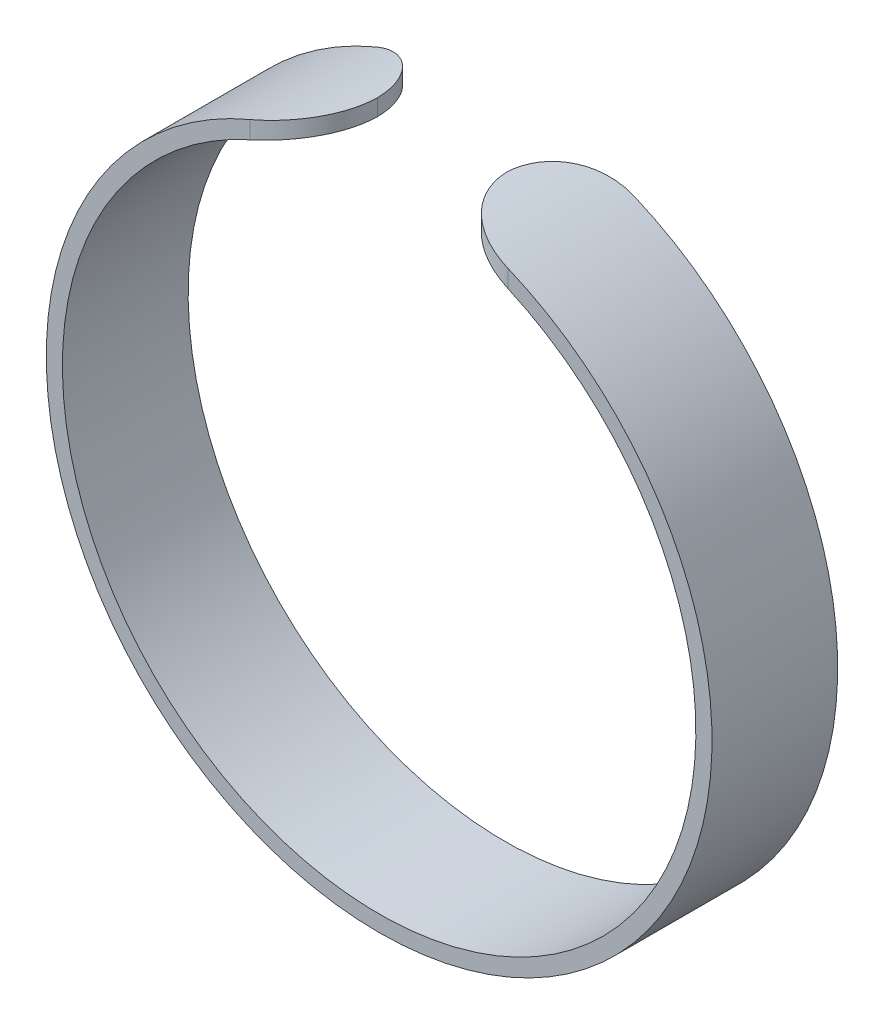
ISO-10303-21;
HEADER;
FILE_DESCRIPTION(('STEP AP214'),'2;1');
FILE_NAME('part.step','',(''),(''),'','','');
FILE_SCHEMA(('AUTOMOTIVE_DESIGN { 1 0 10303 214 1 1 1 1 }'));
ENDSEC;
DATA;
#1=APPLICATION_CONTEXT('core data for automotive mechanical design processes');
#2=APPLICATION_PROTOCOL_DEFINITION('international standard','automotive_design',2000,#1);
#3=PRODUCT_CONTEXT('',#1,'mechanical');
#4=PRODUCT('Part','Part','',(#3));
#5=PRODUCT_RELATED_PRODUCT_CATEGORY('part','',(#4));
#6=PRODUCT_DEFINITION_FORMATION('','',#4);
#7=PRODUCT_DEFINITION_CONTEXT('part definition',#1,'design');
#8=PRODUCT_DEFINITION('design','',#6,#7);
#9=PRODUCT_DEFINITION_SHAPE('','',#8);
#10=(LENGTH_UNIT() NAMED_UNIT(*) SI_UNIT(.MILLI.,.METRE.));
#11=(NAMED_UNIT(*) PLANE_ANGLE_UNIT() SI_UNIT($,.RADIAN.));
#12=(NAMED_UNIT(*) SI_UNIT($,.STERADIAN.) SOLID_ANGLE_UNIT());
#13=UNCERTAINTY_MEASURE_WITH_UNIT(LENGTH_MEASURE(1.E-05),#10,'distance_accuracy_value','');
#14=(GEOMETRIC_REPRESENTATION_CONTEXT(3) GLOBAL_UNCERTAINTY_ASSIGNED_CONTEXT((#13)) GLOBAL_UNIT_ASSIGNED_CONTEXT((#10,
#11,#12)) REPRESENTATION_CONTEXT('',''));
#15=CARTESIAN_POINT('',(0.,0.,0.));
#16=DIRECTION('',(0.,0.,1.));
#17=DIRECTION('',(1.,0.,0.));
#18=AXIS2_PLACEMENT_3D('',#15,#16,#17);
#19=CARTESIAN_POINT('',(0.,0.,7.8));
#20=DIRECTION('',(0.,0.,-1.));
#21=DIRECTION('',(-1.,0.,0.));
#22=AXIS2_PLACEMENT_3D('',#19,#20,#21);
#23=CYLINDRICAL_SURFACE('',#22,19.65);
#24=CARTESIAN_POINT('',(8.,17.9477714494029,7.8));
#25=CARTESIAN_POINT('',(7.88809005336459,17.9976655835803,7.80000932374432));
#26=CARTESIAN_POINT('',(7.7756873025932,18.0465017253565,7.79530340080991));
#27=CARTESIAN_POINT('',(7.55064133487492,18.1418064750824,7.77628156620465));
#28=CARTESIAN_POINT('',(7.43799803981439,18.1882741296171,7.76196181692846));
#29=CARTESIAN_POINT('',(7.21305846917903,18.2786498339844,7.72349007470337));
#30=CARTESIAN_POINT('',(7.10076351091773,18.3225519993548,7.69931641966759));
#31=CARTESIAN_POINT('',(6.87767182517128,18.4074540659507,7.64105025839636));
#32=CARTESIAN_POINT('',(6.76687489585689,18.4484543613613,7.60695910256487));
#33=CARTESIAN_POINT('',(6.54740160579019,18.5274843197794,7.52874852095477));
#34=CARTESIAN_POINT('',(6.43873185566586,18.5655055724089,7.48460198754323));
#35=CARTESIAN_POINT('',(6.22477364762981,18.638333320516,7.38642300724263));
#36=CARTESIAN_POINT('',(6.11948649348473,18.6731385859143,7.33238680102611));
#37=CARTESIAN_POINT('',(5.91353097446289,18.7393792476117,7.21477446345511));
#38=CARTESIAN_POINT('',(5.81285479629114,18.7708204749899,7.15121531348969));
#39=CARTESIAN_POINT('',(5.61689209674453,18.8303880955477,7.01481747190429));
#40=CARTESIAN_POINT('',(5.52160744729377,18.858513341056,6.94197558554557));
#41=CARTESIAN_POINT('',(5.34295727866647,18.9098764253134,6.79213852492775));
#42=CARTESIAN_POINT('',(5.25921974354145,18.9333059355996,6.71565204759649));
#43=CARTESIAN_POINT('',(5.09815016610083,18.9773111598539,6.55539068405679));
#44=CARTESIAN_POINT('',(5.02082047631787,18.997885827568,6.47161314399785));
#45=CARTESIAN_POINT('',(4.87332486779742,19.0362552552994,6.2973847203321));
#46=CARTESIAN_POINT('',(4.8031587605346,19.0540500884807,6.20693401245226));
#47=CARTESIAN_POINT('',(4.67061697357035,19.0869720968837,6.01998686782708));
#48=CARTESIAN_POINT('',(4.60824400397133,19.1020983448408,5.92348834534482));
#49=CARTESIAN_POINT('',(4.49411200093319,19.1292646991117,5.72898329136068));
#50=CARTESIAN_POINT('',(4.44203935448221,19.1414003519237,5.63117393563152));
#51=CARTESIAN_POINT('',(4.34610695814401,19.1634098472032,5.43136362978417));
#52=CARTESIAN_POINT('',(4.30224707361326,19.1732837267517,5.32936274841708));
#53=CARTESIAN_POINT('',(4.22313964746166,19.1908633542236,5.12198015268878));
#54=CARTESIAN_POINT('',(4.18788569571598,19.1985707165287,5.01660102121456));
#55=CARTESIAN_POINT('',(4.12624791652603,19.2119119969768,4.80318677659015));
#56=CARTESIAN_POINT('',(4.09986177673923,19.21754645568,4.69515236371995));
#57=CARTESIAN_POINT('',(4.05209509983849,19.2276825265249,4.45682773781441));
#58=CARTESIAN_POINT('',(4.0325662502832,19.231776802299,4.32614495170229));
#59=CARTESIAN_POINT('',(4.0065139278119,19.2372131813124,4.0636369360569));
#60=CARTESIAN_POINT('',(3.99997047898154,19.2385595119067,3.93181377509165));
#61=CARTESIAN_POINT('',(4.,19.23856803403,3.8));
#62=B_SPLINE_CURVE_WITH_KNOTS('',3,(#24,#25,#26,#27,#28,#29,#30,#31,#32,#33,#34,#35,#36,#37,#38,
#39,#40,#41,#42,#43,#44,#45,#46,#47,#48,#49,#50,#51,#52,#53,#54,#55,#56,#57,#58,#59,#60,#61),
.UNSPECIFIED.,.F.,.F.,(4,2,2,2,2,2,2,2,2,2,2,2,2,2,2,2,2,2,4),(0.,0.367518755734606,
0.735184303300681,1.1036624958823,1.47209053856201,1.84152381084964,2.21109780732097,
2.58002045193414,2.94907040929297,3.29605563121936,3.64316768367631,3.9902705987649,
4.33749388663024,4.67150198549099,5.0055046080006,5.33925768448197,5.67292366492303,
6.0688267405036,6.46412031040639),.UNSPECIFIED.);
#63=CARTESIAN_POINT('',(8.,17.9477714494029,7.8));
#64=VERTEX_POINT('',#63);
#65=CARTESIAN_POINT('',(4.00125019537356,19.238308056428,3.90000000000001));
#66=VERTEX_POINT('',#65);
#67=EDGE_CURVE('E95',#64,#66,#62,.T.);
#68=ORIENTED_EDGE('',*,*,#67,.T.);
#69=CARTESIAN_POINT('',(4.,19.23856803403,4.));
#70=CARTESIAN_POINT('',(3.99998686648455,19.2385636154754,3.88976359395474));
#71=CARTESIAN_POINT('',(4.00455646941222,19.2376204481508,3.77952890042628));
#72=CARTESIAN_POINT('',(4.02276647551041,19.2338246294461,3.55984974181067));
#73=CARTESIAN_POINT('',(4.03640642006805,19.230972074608,3.45040523705295));
#74=CARTESIAN_POINT('',(4.07264567526738,19.2233290392251,3.23318253177841));
#75=CARTESIAN_POINT('',(4.09523668144896,19.2185403548649,3.12540288269779));
#76=CARTESIAN_POINT('',(4.1491915360695,19.2069642400032,2.91217353233591));
#77=CARTESIAN_POINT('',(4.18055527305315,19.2001768348948,2.80672380147199));
#78=CARTESIAN_POINT('',(4.25181262401648,19.1845228727622,2.59886983943899));
#79=CARTESIAN_POINT('',(4.29170882070096,19.1756556861267,2.49646654111442));
#80=CARTESIAN_POINT('',(4.37971378303572,19.1557469757686,2.29542601859533));
#81=CARTESIAN_POINT('',(4.42782556813214,19.1447046523957,2.19679019541561));
#82=CARTESIAN_POINT('',(4.53182520368987,19.1203532732055,2.00406743444661));
#83=CARTESIAN_POINT('',(4.58770898309481,19.107045403294,1.9099781496745));
#84=CARTESIAN_POINT('',(4.70682624491163,19.0780513609658,1.72691032377081));
#85=CARTESIAN_POINT('',(4.77006243110007,19.0623643129797,1.63793368085091));
#86=CARTESIAN_POINT('',(4.90343234663499,19.0284941544969,1.4656051789483));
#87=CARTESIAN_POINT('',(4.97357596925769,19.0103074486424,1.38226168470056));
#88=CARTESIAN_POINT('',(5.12011620635392,18.9713641610258,1.22185767490934));
#89=CARTESIAN_POINT('',(5.19651509551086,18.9506066429867,1.14479946548142));
#90=CARTESIAN_POINT('',(5.35486409459992,18.9064719182761,0.997510608198759));
#91=CARTESIAN_POINT('',(5.43681175344822,18.8830958653545,0.927276978648159));
#92=CARTESIAN_POINT('',(5.60563206854721,18.8336700941089,0.793978182999315));
#93=CARTESIAN_POINT('',(5.69250653346818,18.8076193910177,0.730915675344303));
#94=CARTESIAN_POINT('',(5.87173745998371,18.7524426741433,0.611451796374919));
#95=CARTESIAN_POINT('',(5.96415507210383,18.7232776027059,0.555160061224639));
#96=CARTESIAN_POINT('',(6.15255034410345,18.6622202525107,0.450554900947445));
#97=CARTESIAN_POINT('',(6.24852932747501,18.6303269540118,0.402244478981285));
#98=CARTESIAN_POINT('',(6.54071490293849,18.5306149270078,0.269564453376967));
#99=CARTESIAN_POINT('',(6.74124503556162,18.4587413149161,0.197396619924834));
#100=CARTESIAN_POINT('',(7.11883686627214,18.3161010492841,0.094062206376543));
#101=CARTESIAN_POINT('',(7.29522339307869,18.2466057745343,0.0585507918245499));
#102=CARTESIAN_POINT('',(7.55997053818128,18.1377632219468,0.0232819522319069));
#103=CARTESIAN_POINT('',(7.64817020422259,18.1007501681725,0.0145252013667476));
#104=CARTESIAN_POINT('',(7.82433845957854,18.0252996524898,0.00288418588088229));
#105=CARTESIAN_POINT('',(7.91230707091564,17.9868623320296,-6.60313327061912E-07));
#106=CARTESIAN_POINT('',(8.,17.9477714494029,0.));
#107=B_SPLINE_CURVE_WITH_KNOTS('',3,(#69,#70,#71,#72,#73,#74,#75,#76,#77,#78,#79,#80,#81,#82,
#83,#84,#85,#86,#87,#88,#89,#90,#91,#92,#93,#94,#95,#96,#97,#98,#99,#100,#101,#102,#103,#104,
#105,#106),.UNSPECIFIED.,.F.,.F.,(4,2,2,2,2,2,2,2,2,2,2,2,2,2,2,2,2,2,4),(0.,0.330608103613877,
0.66119949235481,0.991484886256581,1.32176608415694,1.65214739729132,1.98265039667453,
2.31298092245551,2.64343331061127,2.97436607500152,3.30541971983177,3.63632806898527,
3.96735869367631,4.30318110384059,4.63912958886603,5.31075195860414,5.88772673971597,
6.17571042114153,6.46366557829104),.UNSPECIFIED.);
#108=CARTESIAN_POINT('',(8.,17.9477714494029,0.));
#109=VERTEX_POINT('',#108);
#110=EDGE_CURVE('E90',#66,#109,#107,.T.);
#111=ORIENTED_EDGE('',*,*,#110,.T.);
#112=CARTESIAN_POINT('',(0.,0.,0.));
#113=DIRECTION('',(0.,0.,-1.));
#114=DIRECTION('',(1.,0.,0.));
#115=AXIS2_PLACEMENT_3D('',#112,#113,#114);
#116=CIRCLE('',#115,19.65);
#117=CARTESIAN_POINT('',(-8.00000000000001,17.9477714494028,0.));
#118=VERTEX_POINT('',#117);
#119=EDGE_CURVE('E92',#109,#118,#116,.T.);
#120=ORIENTED_EDGE('',*,*,#119,.T.);
#121=CARTESIAN_POINT('',(-8.00000000000001,17.9477714494028,0.));
#122=CARTESIAN_POINT('',(-7.8880900533646,17.9976655835803,-9.32374431702631E-06));
#123=CARTESIAN_POINT('',(-7.7756873025932,18.0465017253565,0.00469659919009254));
#124=CARTESIAN_POINT('',(-7.55064133487493,18.1418064750824,0.023718433795353));
#125=CARTESIAN_POINT('',(-7.4379980398144,18.1882741296171,0.0380381830715341));
#126=CARTESIAN_POINT('',(-7.21305846917904,18.2786498339844,0.0765099252966335));
#127=CARTESIAN_POINT('',(-7.10076351091774,18.3225519993548,0.100683580332411));
#128=CARTESIAN_POINT('',(-6.87767182517128,18.4074540659507,0.15894974160364));
#129=CARTESIAN_POINT('',(-6.7668748958569,18.4484543613613,0.193040897435133));
#130=CARTESIAN_POINT('',(-6.54740160579019,18.5274843197794,0.271251479045227));
#131=CARTESIAN_POINT('',(-6.43873185566586,18.5655055724089,0.315398012456776));
#132=CARTESIAN_POINT('',(-6.22477364762981,18.638333320516,0.413576992757369));
#133=CARTESIAN_POINT('',(-6.11948649348474,18.6731385859143,0.467613198973888));
#134=CARTESIAN_POINT('',(-5.91353097446289,18.7393792476117,0.585225536544889));
#135=CARTESIAN_POINT('',(-5.81285479629114,18.7708204749899,0.648784686510316));
#136=CARTESIAN_POINT('',(-5.61689209674453,18.8303880955477,0.785182528095711));
#137=CARTESIAN_POINT('',(-5.52160744729377,18.858513341056,0.858024414454432));
#138=CARTESIAN_POINT('',(-5.34295727866647,18.9098764253134,1.00786147507226));
#139=CARTESIAN_POINT('',(-5.25921974354145,18.9333059355996,1.08434795240352));
#140=CARTESIAN_POINT('',(-5.09815016610083,18.9773111598539,1.24460931594322));
#141=CARTESIAN_POINT('',(-5.02082047631787,18.997885827568,1.32838685600216));
#142=CARTESIAN_POINT('',(-4.87332486779742,19.0362552552994,1.50261527966791));
#143=CARTESIAN_POINT('',(-4.8031587605346,19.0540500884807,1.59306598754775));
#144=CARTESIAN_POINT('',(-4.67061697357036,19.0869720968837,1.78001313217293));
#145=CARTESIAN_POINT('',(-4.60824400397133,19.1020983448408,1.87651165465518));
#146=CARTESIAN_POINT('',(-4.49411200093319,19.1292646991117,2.07101670863933));
#147=CARTESIAN_POINT('',(-4.44203935448221,19.1414003519237,2.16882606436849));
#148=CARTESIAN_POINT('',(-4.34610695814401,19.1634098472032,2.36863637021584));
#149=CARTESIAN_POINT('',(-4.30224707361327,19.1732837267517,2.47063725158293));
#150=CARTESIAN_POINT('',(-4.22313964746166,19.1908633542236,2.67801984731123));
#151=CARTESIAN_POINT('',(-4.18788569571599,19.1985707165287,2.78339897878545));
#152=CARTESIAN_POINT('',(-4.12624791652604,19.2119119969768,2.99681322340986));
#153=CARTESIAN_POINT('',(-4.09986177673924,19.21754645568,3.10484763628006));
#154=CARTESIAN_POINT('',(-4.05209509983849,19.2276825265249,3.3431722621856));
#155=CARTESIAN_POINT('',(-4.0325662502832,19.231776802299,3.47385504829771));
#156=CARTESIAN_POINT('',(-4.00651392781191,19.2372131813124,3.7363630639431));
#157=CARTESIAN_POINT('',(-3.99997047898154,19.2385595119067,3.86818622490835));
#158=CARTESIAN_POINT('',(-4.,19.23856803403,4.));
#159=B_SPLINE_CURVE_WITH_KNOTS('',3,(#121,#122,#123,#124,#125,#126,#127,#128,#129,#130,#131,
#132,#133,#134,#135,#136,#137,#138,#139,#140,#141,#142,#143,#144,#145,#146,#147,#148,#149,#150,
#151,#152,#153,#154,#155,#156,#157,#158),.UNSPECIFIED.,.F.,.F.,(4,2,2,2,2,2,2,2,2,2,2,2,2,2,2,2,
2,2,4),(0.,0.367518755734607,0.735184303300683,1.1036624958823,1.47209053856202,
1.84152381084964,2.21109780732098,2.58002045193415,2.94907040929299,3.29605563121938,
3.64316768367633,3.99027059876491,4.33749388663025,4.671501985491,5.00550460800062,
5.33925768448199,5.67292366492305,6.06882674050361,6.4641203104064),.UNSPECIFIED.);
#160=CARTESIAN_POINT('',(-4.00125019537356,19.238308056428,3.89999999999997));
#161=VERTEX_POINT('',#160);
#162=EDGE_CURVE('E161',#118,#161,#159,.T.);
#163=ORIENTED_EDGE('',*,*,#162,.T.);
#164=CARTESIAN_POINT('',(-4.,19.23856803403,3.8));
#165=CARTESIAN_POINT('',(-3.99998686648455,19.2385636154754,3.91023640604526));
#166=CARTESIAN_POINT('',(-4.00455646941223,19.2376204481508,4.02047109957372));
#167=CARTESIAN_POINT('',(-4.02276647551042,19.2338246294461,4.24015025818933));
#168=CARTESIAN_POINT('',(-4.03640642006806,19.230972074608,4.34959476294704));
#169=CARTESIAN_POINT('',(-4.07264567526739,19.2233290392251,4.56681746822159));
#170=CARTESIAN_POINT('',(-4.09523668144897,19.2185403548649,4.6745971173022));
#171=CARTESIAN_POINT('',(-4.14919153606951,19.2069642400032,4.88782646766409));
#172=CARTESIAN_POINT('',(-4.18055527305316,19.2001768348948,4.99327619852801));
#173=CARTESIAN_POINT('',(-4.25181262401649,19.1845228727622,5.20113016056101));
#174=CARTESIAN_POINT('',(-4.29170882070097,19.1756556861267,5.30353345888558));
#175=CARTESIAN_POINT('',(-4.37971378303573,19.1557469757686,5.50457398140467));
#176=CARTESIAN_POINT('',(-4.42782556813215,19.1447046523957,5.60320980458439));
#177=CARTESIAN_POINT('',(-4.53182520368987,19.1203532732055,5.79593256555339));
#178=CARTESIAN_POINT('',(-4.58770898309482,19.1070454032939,5.8900218503255));
#179=CARTESIAN_POINT('',(-4.70682624491164,19.0780513609658,6.07308967622919));
#180=CARTESIAN_POINT('',(-4.77006243110007,19.0623643129797,6.16206631914909));
#181=CARTESIAN_POINT('',(-4.903432346635,19.0284941544969,6.3343948210517));
#182=CARTESIAN_POINT('',(-4.9735759692577,19.0103074486424,6.41773831529944));
#183=CARTESIAN_POINT('',(-5.12011620635393,18.9713641610258,6.57814232509066));
#184=CARTESIAN_POINT('',(-5.19651509551087,18.9506066429867,6.65520053451858));
#185=CARTESIAN_POINT('',(-5.35486409459993,18.9064719182761,6.80248939180124));
#186=CARTESIAN_POINT('',(-5.43681175344823,18.8830958653545,6.87272302135184));
#187=CARTESIAN_POINT('',(-5.60563206854722,18.8336700941089,7.00602181700068));
#188=CARTESIAN_POINT('',(-5.69250653346818,18.8076193910177,7.06908432465569));
#189=CARTESIAN_POINT('',(-5.87173745998371,18.7524426741433,7.18854820362508));
#190=CARTESIAN_POINT('',(-5.96415507210383,18.7232776027059,7.24483993877536));
#191=CARTESIAN_POINT('',(-6.15255034410345,18.6622202525107,7.34944509905255));
#192=CARTESIAN_POINT('',(-6.24852932747501,18.6303269540118,7.39775552101871));
#193=CARTESIAN_POINT('',(-6.54071490293849,18.5306149270078,7.53043554662303));
#194=CARTESIAN_POINT('',(-6.74124503556163,18.4587413149161,7.60260338007516));
#195=CARTESIAN_POINT('',(-7.11883686627215,18.3161010492841,7.70593779362346));
#196=CARTESIAN_POINT('',(-7.2952233930787,18.2466057745343,7.74144920817545));
#197=CARTESIAN_POINT('',(-7.55997053818129,18.1377632219468,7.77671804776809));
#198=CARTESIAN_POINT('',(-7.6481702042226,18.1007501681725,7.78547479863325));
#199=CARTESIAN_POINT('',(-7.82433845957855,18.0252996524898,7.79711581411912));
#200=CARTESIAN_POINT('',(-7.91230707091565,17.9868623320296,7.80000066031333));
#201=CARTESIAN_POINT('',(-8.00000000000001,17.9477714494028,7.8));
#202=B_SPLINE_CURVE_WITH_KNOTS('',3,(#164,#165,#166,#167,#168,#169,#170,#171,#172,#173,#174,
#175,#176,#177,#178,#179,#180,#181,#182,#183,#184,#185,#186,#187,#188,#189,#190,#191,#192,#193,
#194,#195,#196,#197,#198,#199,#200,#201),.UNSPECIFIED.,.F.,.F.,(4,2,2,2,2,2,2,2,2,2,2,2,2,2,2,2,
2,2,4),(0.,0.330608103613877,0.661199492354809,0.99148488625658,1.32176608415694,
1.65214739729132,1.98265039667453,2.31298092245552,2.64343331061128,2.97436607500152,
3.30541971983177,3.63632806898527,3.96735869367631,4.30318110384059,4.63912958886603,
5.31075195860413,5.88772673971597,6.17571042114154,6.46366557829105),.UNSPECIFIED.);
#203=CARTESIAN_POINT('',(-8.00000000000001,17.9477714494028,7.8));
#204=VERTEX_POINT('',#203);
#205=EDGE_CURVE('E169',#161,#204,#202,.T.);
#206=ORIENTED_EDGE('',*,*,#205,.T.);
#207=CARTESIAN_POINT('',(0.,0.,7.8));
#208=DIRECTION('',(0.,0.,-1.));
#209=DIRECTION('',(1.,0.,0.));
#210=AXIS2_PLACEMENT_3D('',#207,#208,#209);
#211=CIRCLE('',#210,19.65);
#212=EDGE_CURVE('E175',#64,#204,#211,.T.);
#213=ORIENTED_EDGE('',*,*,#212,.F.);
#214=EDGE_LOOP('',(#68,#111,#120,#163,#206,#213));
#215=FACE_BOUND('',#214,.T.);
#216=ADVANCED_FACE('F35',(#215),#23,.F.);
#217=CARTESIAN_POINT('',(0.,0.,7.8));
#218=DIRECTION('',(0.,0.,-1.));
#219=DIRECTION('',(-1.,0.,0.));
#220=AXIS2_PLACEMENT_3D('',#217,#218,#219);
#221=CYLINDRICAL_SURFACE('',#220,20.65);
#222=CARTESIAN_POINT('',(0.,0.,0.));
#223=DIRECTION('',(0.,0.,1.));
#224=DIRECTION('',(1.,0.,0.));
#225=AXIS2_PLACEMENT_3D('',#222,#223,#224);
#226=CIRCLE('',#225,20.65);
#227=CARTESIAN_POINT('',(-8.00000000000001,19.0373974061582,0.));
#228=VERTEX_POINT('',#227);
#229=CARTESIAN_POINT('',(8.,19.0373974061582,0.));
#230=VERTEX_POINT('',#229);
#231=EDGE_CURVE('E109',#228,#230,#226,.T.);
#232=ORIENTED_EDGE('',*,*,#231,.T.);
#233=CARTESIAN_POINT('',(8.,19.0373974061582,0.));
#234=CARTESIAN_POINT('',(7.88801991177646,19.0844651702443,-9.61645803382828E-06));
#235=CARTESIAN_POINT('',(7.77560107805466,19.1305333367053,0.0047024167130644));
#236=CARTESIAN_POINT('',(7.55063599195092,19.2204308910369,0.0237203550945149));
#237=CARTESIAN_POINT('',(7.4380897084812,19.2642594772961,0.0380296699233114));
#238=CARTESIAN_POINT('',(7.2134878134453,19.3494851776599,0.0764293289514073));
#239=CARTESIAN_POINT('',(7.10143353671701,19.3908775243053,0.100538165915066));
#240=CARTESIAN_POINT('',(6.87891865168001,19.470925736618,0.158594781993855));
#241=CARTESIAN_POINT('',(6.76845784766073,19.5095819406568,0.192541341849818));
#242=CARTESIAN_POINT('',(6.54976338303463,19.5840874105833,0.27034629916117));
#243=CARTESIAN_POINT('',(6.44153591731002,19.6199294859551,0.314229041758163));
#244=CARTESIAN_POINT('',(6.22851261333964,19.6885921122131,0.411747091554131));
#245=CARTESIAN_POINT('',(6.12371809240857,19.7214115117676,0.465386091941208));
#246=CARTESIAN_POINT('',(5.91874980628709,19.7838915111392,0.582064756525221));
#247=CARTESIAN_POINT('',(5.81856879685724,19.8135571660666,0.645088975631585));
#248=CARTESIAN_POINT('',(5.62357777370212,19.869780418638,0.780264865337175));
#249=CARTESIAN_POINT('',(5.52876964228325,19.8963369304716,0.852419706439391));
#250=CARTESIAN_POINT('',(5.35042191332044,19.9450136558673,1.00125117655004));
#251=CARTESIAN_POINT('',(5.26655069246968,19.9672953734111,1.07747803030275));
#252=CARTESIAN_POINT('',(5.10522122760203,20.0091520330463,1.2371856840178));
#253=CARTESIAN_POINT('',(5.02776534526005,20.0287259800892,1.32066913237155));
#254=CARTESIAN_POINT('',(4.88001018559767,20.0652384538619,1.49427532137171));
#255=CARTESIAN_POINT('',(4.80971060678917,20.0821770916307,1.58439778204706));
#256=CARTESIAN_POINT('',(4.67687919397024,20.1135268325019,1.77066006787088));
#257=CARTESIAN_POINT('',(4.61435006992247,20.1279370545317,1.86680197483308));
#258=CARTESIAN_POINT('',(4.49966953980952,20.1538783301026,2.0609394807028));
#259=CARTESIAN_POINT('',(4.44723456442481,20.1654915517932,2.158756745646));
#260=CARTESIAN_POINT('',(4.35059936158604,20.1865606663226,2.35860002791256));
#261=CARTESIAN_POINT('',(4.30639901550592,20.1960165902392,2.46062598458068));
#262=CARTESIAN_POINT('',(4.22662916865828,20.2128615184495,2.66807954945382));
#263=CARTESIAN_POINT('',(4.19105348184226,20.2202520047659,2.77350465775263));
#264=CARTESIAN_POINT('',(4.12879064463516,20.2330568057369,2.9870298354714));
#265=CARTESIAN_POINT('',(4.10210121819521,20.2384716264554,3.09512921229536));
#266=CARTESIAN_POINT('',(4.05339541856416,20.2482905526915,3.33507644223347));
#267=CARTESIAN_POINT('',(4.03337948394125,20.2522762843493,3.46735223577799));
#268=CARTESIAN_POINT('',(4.0066765711108,20.257568187317,3.73309024413077));
#269=CARTESIAN_POINT('',(3.99996927345758,20.2588784435955,3.8665503373079));
#270=CARTESIAN_POINT('',(4.,20.2588869388227,4.));
#271=B_SPLINE_CURVE_WITH_KNOTS('',3,(#233,#234,#235,#236,#237,#238,#239,#240,#241,#242,#243,
#244,#245,#246,#247,#248,#249,#250,#251,#252,#253,#254,#255,#256,#257,#258,#259,#260,#261,#262,
#263,#264,#265,#266,#267,#268,#269,#270),.UNSPECIFIED.,.F.,.F.,(4,2,2,2,2,2,2,2,2,2,2,2,2,2,2,2,
2,2,4),(0.,0.364338786012961,0.728807078981445,1.09396638030283,1.45908044416799,
1.82509896301786,2.19125632601167,2.55681763659739,2.92250623424871,3.26859065768149,
3.61480192389581,3.96099859852504,4.30731567314858,4.64168690256026,4.97605331472901,
5.31017918785049,5.6442194149449,6.04502961296618,6.44522738710803),.UNSPECIFIED.);
#272=CARTESIAN_POINT('',(4.00125019537356,20.2586400549006,3.89999999999999));
#273=VERTEX_POINT('',#272);
#274=EDGE_CURVE('E53',#230,#273,#271,.T.);
#275=ORIENTED_EDGE('',*,*,#274,.T.);
#276=CARTESIAN_POINT('',(4.,20.2588869388227,3.8));
#277=CARTESIAN_POINT('',(3.9999869589523,20.2588826989038,3.91045276225946));
#278=CARTESIAN_POINT('',(4.0045743788701,20.2579835402437,4.02090380966646));
#279=CARTESIAN_POINT('',(4.02285611970234,20.254364695957,4.24101427269968));
#280=CARTESIAN_POINT('',(4.03654998233435,20.251645101944,4.35067372788214));
#281=CARTESIAN_POINT('',(4.07293405020711,20.2443580189029,4.56832504535302));
#282=CARTESIAN_POINT('',(4.09561606104843,20.2397922129696,4.67631833375417));
#283=CARTESIAN_POINT('',(4.14979125230746,20.2287543169084,4.88997062372404));
#284=CARTESIAN_POINT('',(4.18128432119924,20.2222822509089,4.99562965482036));
#285=CARTESIAN_POINT('',(4.25284068594218,20.2073545933968,5.20389637771441));
#286=CARTESIAN_POINT('',(4.29290657526298,20.1988984015669,5.30650313540809));
#287=CARTESIAN_POINT('',(4.38129408640718,20.1799109281053,5.50794301533185));
#288=CARTESIAN_POINT('',(4.42961874442463,20.1693788831031,5.60677473332609));
#289=CARTESIAN_POINT('',(4.53409056976994,20.1461505730912,5.79987909755671));
#290=CARTESIAN_POINT('',(4.59023362157747,20.1334554459244,5.89415410745282));
#291=CARTESIAN_POINT('',(4.70992054205286,20.1057932117385,6.07758076219444));
#292=CARTESIAN_POINT('',(4.77346713304658,20.0908252683736,6.16673050433864));
#293=CARTESIAN_POINT('',(4.90750378742401,20.0585060092431,6.33937502977373));
#294=CARTESIAN_POINT('',(4.97800272918544,20.0411516344809,6.42286234633384));
#295=CARTESIAN_POINT('',(5.12531374637776,20.0039853511166,6.58353418133736));
#296=CARTESIAN_POINT('',(5.20212812178149,19.9841725458465,6.6607163829828));
#297=CARTESIAN_POINT('',(5.36137574872401,19.9420392201543,6.80822814193691));
#298=CARTESIAN_POINT('',(5.44380665540694,19.9197197437543,6.8785605295529));
#299=CARTESIAN_POINT('',(5.61366503732317,19.8725196977168,7.01202083746527));
#300=CARTESIAN_POINT('',(5.70109434295617,19.847638187163,7.07514609283902));
#301=CARTESIAN_POINT('',(5.88140320438407,19.7949620273021,7.19461206840081));
#302=CARTESIAN_POINT('',(5.97433939775076,19.7671333116338,7.250852427404));
#303=CARTESIAN_POINT('',(6.16384347753876,19.7088659349009,7.355314035848));
#304=CARTESIAN_POINT('',(6.2604127260049,19.678426289404,7.40353224027095));
#305=CARTESIAN_POINT('',(6.55446450179837,19.5832510309271,7.53584331965625));
#306=CARTESIAN_POINT('',(6.75638723242667,19.51463137758,7.60765583137141));
#307=CARTESIAN_POINT('',(7.13258211295835,19.3799404849442,7.70886497707664));
#308=CARTESIAN_POINT('',(7.30604927078716,19.315249499765,7.74324076824254));
#309=CARTESIAN_POINT('',(7.5665846984226,19.2140047740255,7.77741234581396));
#310=CARTESIAN_POINT('',(7.65341229356233,19.1795859373957,7.78590433420851));
#311=CARTESIAN_POINT('',(7.82690551428161,19.1094433081465,7.7971984723072));
#312=CARTESIAN_POINT('',(7.91357114893499,19.0737195910865,7.80000095093323));
#313=CARTESIAN_POINT('',(8.,19.0373974061582,7.8));
#314=B_SPLINE_CURVE_WITH_KNOTS('',3,(#276,#277,#278,#279,#280,#281,#282,#283,#284,#285,#286,
#287,#288,#289,#290,#291,#292,#293,#294,#295,#296,#297,#298,#299,#300,#301,#302,#303,#304,#305,
#306,#307,#308,#309,#310,#311,#312,#313),.UNSPECIFIED.,.F.,.F.,(4,2,2,2,2,2,2,2,2,2,2,2,2,2,2,2,
2,2,4),(0.,0.331256990719271,0.66249731216612,0.99343633755282,1.32437117426946,
1.65540626807279,1.98656332405277,2.3175467167562,2.64865220045786,2.98018613119503,
3.31184134032623,3.6433589246317,3.97499869719048,4.31100851515773,4.64714558485435,
5.31906881529155,5.88240563132743,6.16360038840817,6.44477888859657),.UNSPECIFIED.);
#315=CARTESIAN_POINT('',(8.,19.0373974061582,7.8));
#316=VERTEX_POINT('',#315);
#317=EDGE_CURVE('E139',#273,#316,#314,.T.);
#318=ORIENTED_EDGE('',*,*,#317,.T.);
#319=CARTESIAN_POINT('',(0.,0.,7.8));
#320=DIRECTION('',(0.,0.,1.));
#321=DIRECTION('',(1.,0.,0.));
#322=AXIS2_PLACEMENT_3D('',#319,#320,#321);
#323=CIRCLE('',#322,20.65);
#324=CARTESIAN_POINT('',(-8.00000000000001,19.0373974061582,7.8));
#325=VERTEX_POINT('',#324);
#326=EDGE_CURVE('E174',#325,#316,#323,.T.);
#327=ORIENTED_EDGE('',*,*,#326,.F.);
#328=CARTESIAN_POINT('',(-8.00000000000001,19.0373974061582,7.8));
#329=CARTESIAN_POINT('',(-7.88801991177647,19.0844651702443,7.80000961645803));
#330=CARTESIAN_POINT('',(-7.77560107805466,19.1305333367053,7.79529758328693));
#331=CARTESIAN_POINT('',(-7.55063599195093,19.2204308910369,7.77627964490548));
#332=CARTESIAN_POINT('',(-7.4380897084812,19.2642594772961,7.76197033007669));
#333=CARTESIAN_POINT('',(-7.21348781344531,19.3494851776599,7.72357067104859));
#334=CARTESIAN_POINT('',(-7.10143353671702,19.3908775243053,7.69946183408493));
#335=CARTESIAN_POINT('',(-6.87891865168001,19.470925736618,7.64140521800614));
#336=CARTESIAN_POINT('',(-6.76845784766073,19.5095819406568,7.60745865815018));
#337=CARTESIAN_POINT('',(-6.54976338303463,19.5840874105833,7.52965370083883));
#338=CARTESIAN_POINT('',(-6.44153591731002,19.6199294859551,7.48577095824183));
#339=CARTESIAN_POINT('',(-6.22851261333964,19.6885921122131,7.38825290844587));
#340=CARTESIAN_POINT('',(-6.12371809240857,19.7214115117676,7.33461390805879));
#341=CARTESIAN_POINT('',(-5.91874980628709,19.7838915111392,7.21793524347477));
#342=CARTESIAN_POINT('',(-5.81856879685724,19.8135571660666,7.15491102436841));
#343=CARTESIAN_POINT('',(-5.62357777370212,19.869780418638,7.01973513466282));
#344=CARTESIAN_POINT('',(-5.52876964228325,19.8963369304716,6.9475802935606));
#345=CARTESIAN_POINT('',(-5.35042191332044,19.9450136558673,6.79874882344995));
#346=CARTESIAN_POINT('',(-5.26655069246968,19.9672953734111,6.72252196969724));
#347=CARTESIAN_POINT('',(-5.10522122760203,20.0091520330463,6.56281431598219));
#348=CARTESIAN_POINT('',(-5.02776534526005,20.0287259800892,6.47933086762844));
#349=CARTESIAN_POINT('',(-4.88001018559767,20.0652384538619,6.30572467862828));
#350=CARTESIAN_POINT('',(-4.80971060678916,20.0821770916307,6.21560221795294));
#351=CARTESIAN_POINT('',(-4.67687919397024,20.1135268325019,6.02933993212911));
#352=CARTESIAN_POINT('',(-4.61435006992247,20.1279370545317,5.93319802516692));
#353=CARTESIAN_POINT('',(-4.49966953980952,20.1538783301026,5.73906051929719));
#354=CARTESIAN_POINT('',(-4.44723456442481,20.1654915517932,5.64124325435399));
#355=CARTESIAN_POINT('',(-4.35059936158604,20.1865606663226,5.44139997208743));
#356=CARTESIAN_POINT('',(-4.30639901550592,20.1960165902392,5.33937401541931));
#357=CARTESIAN_POINT('',(-4.22662916865828,20.2128615184495,5.13192045054617));
#358=CARTESIAN_POINT('',(-4.19105348184226,20.2202520047659,5.02649534224737));
#359=CARTESIAN_POINT('',(-4.12879064463516,20.2330568057369,4.81297016452859));
#360=CARTESIAN_POINT('',(-4.10210121819521,20.2384716264554,4.70487078770463));
#361=CARTESIAN_POINT('',(-4.05339541856416,20.2482905526915,4.46492355776652));
#362=CARTESIAN_POINT('',(-4.03337948394125,20.2522762843493,4.332647764222));
#363=CARTESIAN_POINT('',(-4.0066765711108,20.257568187317,4.06690975586923));
#364=CARTESIAN_POINT('',(-3.99996927345758,20.2588784435955,3.9334496626921));
#365=CARTESIAN_POINT('',(-4.,20.2588869388227,3.8));
#366=B_SPLINE_CURVE_WITH_KNOTS('',3,(#328,#329,#330,#331,#332,#333,#334,#335,#336,#337,#338,
#339,#340,#341,#342,#343,#344,#345,#346,#347,#348,#349,#350,#351,#352,#353,#354,#355,#356,#357,
#358,#359,#360,#361,#362,#363,#364,#365),.UNSPECIFIED.,.F.,.F.,(4,2,2,2,2,2,2,2,2,2,2,2,2,2,2,2,
2,2,4),(0.,0.364338786012964,0.728807078981448,1.09396638030284,1.45908044416799,
1.82509896301787,2.19125632601168,2.5568176365974,2.92250623424873,3.2685906576815,
3.61480192389583,3.96099859852505,4.30731567314859,4.64168690256027,4.97605331472902,
5.3101791878505,5.64421941494491,6.04502961296618,6.44522738710803),.UNSPECIFIED.);
#367=CARTESIAN_POINT('',(-4.00125019537356,20.2586400549006,3.89999999999997));
#368=VERTEX_POINT('',#367);
#369=EDGE_CURVE('E60',#325,#368,#366,.T.);
#370=ORIENTED_EDGE('',*,*,#369,.T.);
#371=CARTESIAN_POINT('',(-4.,20.2588869388227,4.));
#372=CARTESIAN_POINT('',(-3.9999869589523,20.2588826989038,3.88954723774054));
#373=CARTESIAN_POINT('',(-4.0045743788701,20.2579835402437,3.77909619033354));
#374=CARTESIAN_POINT('',(-4.02285611970234,20.254364695957,3.55898572730032));
#375=CARTESIAN_POINT('',(-4.03654998233435,20.251645101944,3.44932627211786));
#376=CARTESIAN_POINT('',(-4.07293405020712,20.2443580189029,3.23167495464698));
#377=CARTESIAN_POINT('',(-4.09561606104844,20.2397922129696,3.12368166624583));
#378=CARTESIAN_POINT('',(-4.14979125230747,20.2287543169084,2.91002937627596));
#379=CARTESIAN_POINT('',(-4.18128432119924,20.2222822509089,2.80437034517964));
#380=CARTESIAN_POINT('',(-4.25284068594218,20.2073545933968,2.59610362228559));
#381=CARTESIAN_POINT('',(-4.29290657526298,20.1988984015669,2.49349686459191));
#382=CARTESIAN_POINT('',(-4.38129408640718,20.1799109281053,2.29205698466815));
#383=CARTESIAN_POINT('',(-4.42961874442463,20.1693788831031,2.19322526667391));
#384=CARTESIAN_POINT('',(-4.53409056976994,20.1461505730912,2.00012090244329));
#385=CARTESIAN_POINT('',(-4.59023362157748,20.1334554459244,1.90584589254718));
#386=CARTESIAN_POINT('',(-4.70992054205286,20.1057932117385,1.72241923780556));
#387=CARTESIAN_POINT('',(-4.77346713304658,20.0908252683736,1.63326949566137));
#388=CARTESIAN_POINT('',(-4.90750378742401,20.0585060092431,1.46062497022627));
#389=CARTESIAN_POINT('',(-4.97800272918544,20.0411516344809,1.37713765366616));
#390=CARTESIAN_POINT('',(-5.12531374637776,20.0039853511166,1.21646581866265));
#391=CARTESIAN_POINT('',(-5.20212812178149,19.9841725458465,1.13928361701721));
#392=CARTESIAN_POINT('',(-5.36137574872401,19.9420392201543,0.991771858063091));
#393=CARTESIAN_POINT('',(-5.44380665540694,19.9197197437543,0.921439470447106));
#394=CARTESIAN_POINT('',(-5.61366503732317,19.8725196977168,0.787979162534735));
#395=CARTESIAN_POINT('',(-5.70109434295617,19.847638187163,0.724853907160978));
#396=CARTESIAN_POINT('',(-5.88140320438407,19.7949620273021,0.605387931599189));
#397=CARTESIAN_POINT('',(-5.97433939775076,19.7671333116338,0.549147572595998));
#398=CARTESIAN_POINT('',(-6.16384347753876,19.7088659349009,0.444685964151998));
#399=CARTESIAN_POINT('',(-6.2604127260049,19.678426289404,0.396467759729054));
#400=CARTESIAN_POINT('',(-6.55446450179837,19.5832510309271,0.264156680343755));
#401=CARTESIAN_POINT('',(-6.75638723242667,19.51463137758,0.192344168628594));
#402=CARTESIAN_POINT('',(-7.13258211295835,19.3799404849442,0.091135022923362));
#403=CARTESIAN_POINT('',(-7.30604927078716,19.315249499765,0.0567592317574592));
#404=CARTESIAN_POINT('',(-7.5665846984226,19.2140047740255,0.0225876541860385));
#405=CARTESIAN_POINT('',(-7.65341229356233,19.1795859373957,0.0140956657914856));
#406=CARTESIAN_POINT('',(-7.82690551428162,19.1094433081465,0.00280152769280151));
#407=CARTESIAN_POINT('',(-7.913571148935,19.0737195910865,-9.50933228939361E-07));
#408=CARTESIAN_POINT('',(-8.00000000000001,19.0373974061582,0.));
#409=B_SPLINE_CURVE_WITH_KNOTS('',3,(#371,#372,#373,#374,#375,#376,#377,#378,#379,#380,#381,
#382,#383,#384,#385,#386,#387,#388,#389,#390,#391,#392,#393,#394,#395,#396,#397,#398,#399,#400,
#401,#402,#403,#404,#405,#406,#407,#408),.UNSPECIFIED.,.F.,.F.,(4,2,2,2,2,2,2,2,2,2,2,2,2,2,2,2,
2,2,4),(0.,0.331256990719271,0.66249731216612,0.993436337552822,1.32437117426946,
1.65540626807278,1.98656332405277,2.3175467167562,2.64865220045785,2.98018613119503,
3.31184134032623,3.6433589246317,3.97499869719047,4.31100851515772,4.64714558485434,
5.31906881529155,5.88240563132744,6.16360038840817,6.44477888859658),.UNSPECIFIED.);
#410=EDGE_CURVE('E114',#368,#228,#409,.T.);
#411=ORIENTED_EDGE('',*,*,#410,.T.);
#412=EDGE_LOOP('',(#232,#275,#318,#327,#370,#411));
#413=FACE_BOUND('',#412,.T.);
#414=ADVANCED_FACE('F126',(#413),#221,.T.);
#415=CARTESIAN_POINT('',(0.,0.,7.8));
#416=DIRECTION('',(0.,0.,1.));
#417=DIRECTION('',(1.,0.,0.));
#418=AXIS2_PLACEMENT_3D('',#415,#416,#417);
#419=PLANE('',#418);
#420=ORIENTED_EDGE('',*,*,#326,.T.);
#421=DIRECTION('',(0.,-1.,0.));
#422=VECTOR('',#421,1.);
#423=CARTESIAN_POINT('',(8.,19.23856803403,7.8));
#424=LINE('',#423,#422);
#425=EDGE_CURVE('E11',#316,#64,#424,.T.);
#426=ORIENTED_EDGE('',*,*,#425,.T.);
#427=ORIENTED_EDGE('',*,*,#212,.T.);
#428=DIRECTION('',(0.,1.,0.));
#429=VECTOR('',#428,1.);
#430=CARTESIAN_POINT('',(-8.,20.2588869388227,7.8));
#431=LINE('',#430,#429);
#432=EDGE_CURVE('E45',#204,#325,#431,.T.);
#433=ORIENTED_EDGE('',*,*,#432,.T.);
#434=EDGE_LOOP('',(#420,#426,#427,#433));
#435=FACE_BOUND('',#434,.T.);
#436=ADVANCED_FACE('F131',(#435),#419,.T.);
#437=CARTESIAN_POINT('',(0.,0.,0.));
#438=DIRECTION('',(0.,0.,1.));
#439=DIRECTION('',(1.,0.,0.));
#440=AXIS2_PLACEMENT_3D('',#437,#438,#439);
#441=PLANE('',#440);
#442=ORIENTED_EDGE('',*,*,#119,.F.);
#443=DIRECTION('',(0.,-1.,0.));
#444=VECTOR('',#443,1.);
#445=CARTESIAN_POINT('',(8.,0.,0.));
#446=LINE('',#445,#444);
#447=EDGE_CURVE('E107',#109,#230,#446,.F.);
#448=ORIENTED_EDGE('',*,*,#447,.T.);
#449=ORIENTED_EDGE('',*,*,#231,.F.);
#450=DIRECTION('',(0.,1.,0.));
#451=VECTOR('',#450,1.);
#452=CARTESIAN_POINT('',(-8.00000000000009,0.,0.));
#453=LINE('',#452,#451);
#454=EDGE_CURVE('E100',#228,#118,#453,.F.);
#455=ORIENTED_EDGE('',*,*,#454,.T.);
#456=EDGE_LOOP('',(#442,#448,#449,#455));
#457=FACE_BOUND('',#456,.T.);
#458=ADVANCED_FACE('F105',(#457),#441,.F.);
#459=CARTESIAN_POINT('',(8.,0.,3.8));
#460=DIRECTION('',(0.,1.,0.));
#461=DIRECTION('',(0.,0.,1.));
#462=AXIS2_PLACEMENT_3D('',#459,#460,#461);
#463=CYLINDRICAL_SURFACE('',#462,4.);
#464=ORIENTED_EDGE('',*,*,#425,.F.);
#465=ORIENTED_EDGE('',*,*,#317,.F.);
#466=DIRECTION('',(0.,1.,0.));
#467=VECTOR('',#466,1.);
#468=CARTESIAN_POINT('',(4.00125019537356,19.1033291941128,3.9));
#469=LINE('',#468,#467);
#470=EDGE_CURVE('E110',#66,#273,#469,.T.);
#471=ORIENTED_EDGE('',*,*,#470,.F.);
#472=ORIENTED_EDGE('',*,*,#67,.F.);
#473=EDGE_LOOP('',(#464,#465,#471,#472));
#474=FACE_BOUND('',#473,.T.);
#475=ADVANCED_FACE('F148',(#474),#463,.T.);
#476=CARTESIAN_POINT('',(8.,20.2588869388227,4.));
#477=DIRECTION('',(0.,-1.,0.));
#478=DIRECTION('',(0.,0.,-1.));
#479=AXIS2_PLACEMENT_3D('',#476,#477,#478);
#480=CYLINDRICAL_SURFACE('',#479,4.);
#481=ORIENTED_EDGE('',*,*,#274,.F.);
#482=ORIENTED_EDGE('',*,*,#447,.F.);
#483=ORIENTED_EDGE('',*,*,#110,.F.);
#484=ORIENTED_EDGE('',*,*,#470,.T.);
#485=EDGE_LOOP('',(#481,#482,#483,#484));
#486=FACE_BOUND('',#485,.T.);
#487=ADVANCED_FACE('F112',(#486),#480,.T.);
#488=CARTESIAN_POINT('',(-8.00000000000009,0.,3.8));
#489=DIRECTION('',(0.,-1.,0.));
#490=DIRECTION('',(1.,0.,0.));
#491=AXIS2_PLACEMENT_3D('',#488,#489,#490);
#492=CYLINDRICAL_SURFACE('',#491,4.);
#493=ORIENTED_EDGE('',*,*,#432,.F.);
#494=ORIENTED_EDGE('',*,*,#205,.F.);
#495=DIRECTION('',(0.,-1.,0.));
#496=VECTOR('',#495,1.);
#497=CARTESIAN_POINT('',(-4.00125019537356,19.1033291941128,3.9));
#498=LINE('',#497,#496);
#499=EDGE_CURVE('E40',#368,#161,#498,.T.);
#500=ORIENTED_EDGE('',*,*,#499,.F.);
#501=ORIENTED_EDGE('',*,*,#369,.F.);
#502=EDGE_LOOP('',(#493,#494,#500,#501));
#503=FACE_BOUND('',#502,.T.);
#504=ADVANCED_FACE('F37',(#503),#492,.T.);
#505=CARTESIAN_POINT('',(-8.,20.2588869388227,4.));
#506=DIRECTION('',(0.,1.,0.));
#507=DIRECTION('',(-1.,0.,0.));
#508=AXIS2_PLACEMENT_3D('',#505,#506,#507);
#509=CYLINDRICAL_SURFACE('',#508,4.);
#510=ORIENTED_EDGE('',*,*,#162,.F.);
#511=ORIENTED_EDGE('',*,*,#454,.F.);
#512=ORIENTED_EDGE('',*,*,#410,.F.);
#513=ORIENTED_EDGE('',*,*,#499,.T.);
#514=EDGE_LOOP('',(#510,#511,#512,#513));
#515=FACE_BOUND('',#514,.T.);
#516=ADVANCED_FACE('F153',(#515),#509,.T.);
#517=CLOSED_SHELL('',(#216,#414,#436,#458,#475,#487,#504,#516));
#518=MANIFOLD_SOLID_BREP('B2',#517);
#519=ADVANCED_BREP_SHAPE_REPRESENTATION('',(#18,#518),#14);
#520=SHAPE_DEFINITION_REPRESENTATION(#9,#519);
ENDSEC;
END-ISO-10303-21;
